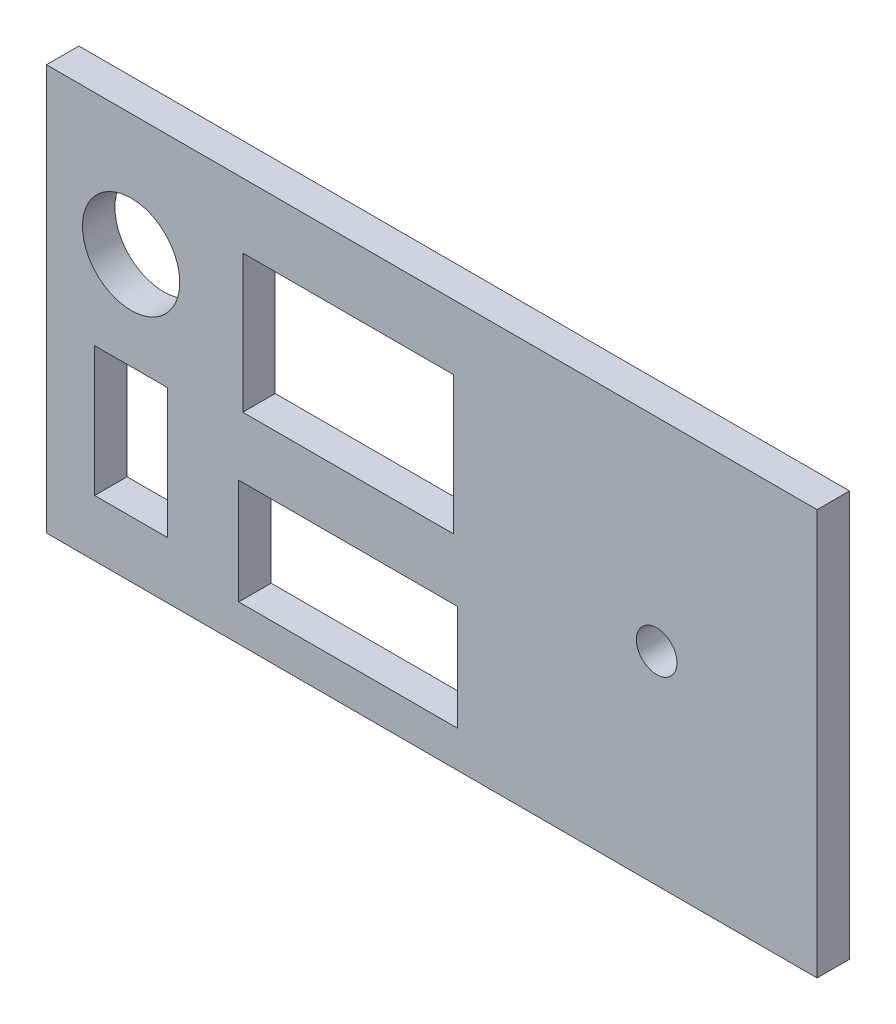
ISO-10303-21;
HEADER;
FILE_DESCRIPTION(('STEP AP214'),'2;1');
FILE_NAME('part.step','',(''),(''),'','','');
FILE_SCHEMA(('AUTOMOTIVE_DESIGN { 1 0 10303 214 1 1 1 1 }'));
ENDSEC;
DATA;
#1=APPLICATION_CONTEXT('core data for automotive mechanical design processes');
#2=APPLICATION_PROTOCOL_DEFINITION('international standard','automotive_design',2000,#1);
#3=PRODUCT_CONTEXT('',#1,'mechanical');
#4=PRODUCT('Part','Part','',(#3));
#5=PRODUCT_RELATED_PRODUCT_CATEGORY('part','',(#4));
#6=PRODUCT_DEFINITION_FORMATION('','',#4);
#7=PRODUCT_DEFINITION_CONTEXT('part definition',#1,'design');
#8=PRODUCT_DEFINITION('design','',#6,#7);
#9=PRODUCT_DEFINITION_SHAPE('','',#8);
#10=(LENGTH_UNIT() NAMED_UNIT(*) SI_UNIT(.MILLI.,.METRE.));
#11=(NAMED_UNIT(*) PLANE_ANGLE_UNIT() SI_UNIT($,.RADIAN.));
#12=(NAMED_UNIT(*) SI_UNIT($,.STERADIAN.) SOLID_ANGLE_UNIT());
#13=UNCERTAINTY_MEASURE_WITH_UNIT(LENGTH_MEASURE(1.E-05),#10,'distance_accuracy_value','');
#14=(GEOMETRIC_REPRESENTATION_CONTEXT(3) GLOBAL_UNCERTAINTY_ASSIGNED_CONTEXT((#13)) GLOBAL_UNIT_ASSIGNED_CONTEXT((#10,
#11,#12)) REPRESENTATION_CONTEXT('',''));
#15=CARTESIAN_POINT('',(0.,0.,0.));
#16=DIRECTION('',(0.,0.,1.));
#17=DIRECTION('',(1.,0.,0.));
#18=AXIS2_PLACEMENT_3D('',#15,#16,#17);
#19=CARTESIAN_POINT('',(0.,0.,4.));
#20=DIRECTION('',(0.,0.,1.));
#21=DIRECTION('',(1.,0.,0.));
#22=AXIS2_PLACEMENT_3D('',#19,#20,#21);
#23=PLANE('',#22);
#24=CARTESIAN_POINT('',(-36.0722,-48.7036,4.));
#25=DIRECTION('',(0.,0.,1.));
#26=DIRECTION('',(-1.,0.,0.));
#27=AXIS2_PLACEMENT_3D('',#24,#25,#26);
#28=ELLIPSE('',#27,2.5,2.5);
#29=CARTESIAN_POINT('',(-38.5722,-48.7036,4.));
#30=VERTEX_POINT('',#29);
#31=EDGE_CURVE('E221',#30,#30,#28,.T.);
#32=ORIENTED_EDGE('',*,*,#31,.F.);
#33=EDGE_LOOP('',(#32));
#34=FACE_BOUND('',#33,.T.);
#35=DIRECTION('',(0.,-1.,0.));
#36=VECTOR('',#35,1.);
#37=CARTESIAN_POINT('',(-111.2985,-23.7036,4.));
#38=LINE('',#37,#36);
#39=CARTESIAN_POINT('',(-111.2985,-23.7036,4.));
#40=VERTEX_POINT('',#39);
#41=CARTESIAN_POINT('',(-111.2985,-73.7036,4.));
#42=VERTEX_POINT('',#41);
#43=EDGE_CURVE('E316',#40,#42,#38,.T.);
#44=ORIENTED_EDGE('',*,*,#43,.T.);
#45=DIRECTION('',(1.,0.,0.));
#46=VECTOR('',#45,1.);
#47=CARTESIAN_POINT('',(-111.2985,-73.7036,4.));
#48=LINE('',#47,#46);
#49=CARTESIAN_POINT('',(-16.2985,-73.7036,4.));
#50=VERTEX_POINT('',#49);
#51=EDGE_CURVE('E320',#42,#50,#48,.T.);
#52=ORIENTED_EDGE('',*,*,#51,.T.);
#53=DIRECTION('',(0.,1.,0.));
#54=VECTOR('',#53,1.);
#55=CARTESIAN_POINT('',(-16.2985,-73.7036,4.));
#56=LINE('',#55,#54);
#57=CARTESIAN_POINT('',(-16.2985,-23.7036,4.));
#58=VERTEX_POINT('',#57);
#59=EDGE_CURVE('E324',#50,#58,#56,.T.);
#60=ORIENTED_EDGE('',*,*,#59,.T.);
#61=DIRECTION('',(-1.,0.,0.));
#62=VECTOR('',#61,1.);
#63=CARTESIAN_POINT('',(-16.2985,-23.7036,4.));
#64=LINE('',#63,#62);
#65=EDGE_CURVE('E327',#58,#40,#64,.T.);
#66=ORIENTED_EDGE('',*,*,#65,.T.);
#67=EDGE_LOOP('',(#44,#52,#60,#66));
#68=FACE_BOUND('',#67,.T.);
#69=DIRECTION('',(1.,0.,0.));
#70=VECTOR('',#69,1.);
#71=CARTESIAN_POINT('',(-87.0985,-48.7036,4.));
#72=LINE('',#71,#70);
#73=CARTESIAN_POINT('',(-87.0985,-48.7036,4.));
#74=VERTEX_POINT('',#73);
#75=CARTESIAN_POINT('',(-61.0985,-48.7036,4.));
#76=VERTEX_POINT('',#75);
#77=EDGE_CURVE('E276',#74,#76,#72,.T.);
#78=ORIENTED_EDGE('',*,*,#77,.F.);
#79=DIRECTION('',(0.,-1.,0.));
#80=VECTOR('',#79,1.);
#81=CARTESIAN_POINT('',(-87.0985,-31.7036,4.));
#82=LINE('',#81,#80);
#83=CARTESIAN_POINT('',(-87.0985,-31.7036,4.));
#84=VERTEX_POINT('',#83);
#85=EDGE_CURVE('E273',#84,#74,#82,.T.);
#86=ORIENTED_EDGE('',*,*,#85,.F.);
#87=DIRECTION('',(-1.,0.,0.));
#88=VECTOR('',#87,1.);
#89=CARTESIAN_POINT('',(-61.0985,-31.7036,4.));
#90=LINE('',#89,#88);
#91=CARTESIAN_POINT('',(-61.0985,-31.7036,4.));
#92=VERTEX_POINT('',#91);
#93=EDGE_CURVE('E284',#92,#84,#90,.T.);
#94=ORIENTED_EDGE('',*,*,#93,.F.);
#95=DIRECTION('',(0.,1.,0.));
#96=VECTOR('',#95,1.);
#97=CARTESIAN_POINT('',(-61.0985,-48.7036,4.));
#98=LINE('',#97,#96);
#99=EDGE_CURVE('E280',#76,#92,#98,.T.);
#100=ORIENTED_EDGE('',*,*,#99,.F.);
#101=EDGE_LOOP('',(#78,#86,#94,#100));
#102=FACE_BOUND('',#101,.T.);
#103=DIRECTION('',(1.,0.,0.));
#104=VECTOR('',#103,1.);
#105=CARTESIAN_POINT('',(-87.5985,-69.2036,4.));
#106=LINE('',#105,#104);
#107=CARTESIAN_POINT('',(-87.5985,-69.2036,4.));
#108=VERTEX_POINT('',#107);
#109=CARTESIAN_POINT('',(-60.5985,-69.2036,4.));
#110=VERTEX_POINT('',#109);
#111=EDGE_CURVE('E233',#108,#110,#106,.T.);
#112=ORIENTED_EDGE('',*,*,#111,.F.);
#113=DIRECTION('',(0.,-1.,0.));
#114=VECTOR('',#113,1.);
#115=CARTESIAN_POINT('',(-87.5985,-56.2036,4.));
#116=LINE('',#115,#114);
#117=CARTESIAN_POINT('',(-87.5985,-56.2036,4.));
#118=VERTEX_POINT('',#117);
#119=EDGE_CURVE('E230',#118,#108,#116,.T.);
#120=ORIENTED_EDGE('',*,*,#119,.F.);
#121=DIRECTION('',(-1.,0.,0.));
#122=VECTOR('',#121,1.);
#123=CARTESIAN_POINT('',(-60.5985,-56.2036,4.));
#124=LINE('',#123,#122);
#125=CARTESIAN_POINT('',(-60.5985,-56.2036,4.));
#126=VERTEX_POINT('',#125);
#127=EDGE_CURVE('E241',#126,#118,#124,.T.);
#128=ORIENTED_EDGE('',*,*,#127,.F.);
#129=DIRECTION('',(0.,1.,0.));
#130=VECTOR('',#129,1.);
#131=CARTESIAN_POINT('',(-60.5985,-69.2036,4.));
#132=LINE('',#131,#130);
#133=EDGE_CURVE('E237',#110,#126,#132,.T.);
#134=ORIENTED_EDGE('',*,*,#133,.F.);
#135=EDGE_LOOP('',(#112,#120,#128,#134));
#136=FACE_BOUND('',#135,.T.);
#137=CARTESIAN_POINT('',(-100.8596,-38.7221,4.));
#138=DIRECTION('',(0.,0.,1.));
#139=DIRECTION('',(-1.,0.,0.));
#140=AXIS2_PLACEMENT_3D('',#137,#138,#139);
#141=ELLIPSE('',#140,6.00000000000001,6.);
#142=CARTESIAN_POINT('',(-106.8596,-38.7221,4.));
#143=VERTEX_POINT('',#142);
#144=EDGE_CURVE('E201',#143,#143,#141,.T.);
#145=ORIENTED_EDGE('',*,*,#144,.F.);
#146=EDGE_LOOP('',(#145));
#147=FACE_BOUND('',#146,.T.);
#148=DIRECTION('',(1.,0.,0.));
#149=VECTOR('',#148,1.);
#150=CARTESIAN_POINT('',(-105.3596,-66.7221,4.));
#151=LINE('',#150,#149);
#152=CARTESIAN_POINT('',(-105.3596,-66.7221,4.));
#153=VERTEX_POINT('',#152);
#154=CARTESIAN_POINT('',(-96.3596,-66.7221,4.));
#155=VERTEX_POINT('',#154);
#156=EDGE_CURVE('E162',#153,#155,#151,.T.);
#157=ORIENTED_EDGE('',*,*,#156,.F.);
#158=DIRECTION('',(0.,-1.,0.));
#159=VECTOR('',#158,1.);
#160=CARTESIAN_POINT('',(-105.3596,-50.7221,4.));
#161=LINE('',#160,#159);
#162=CARTESIAN_POINT('',(-105.3596,-50.7221,4.));
#163=VERTEX_POINT('',#162);
#164=EDGE_CURVE('E153',#163,#153,#161,.T.);
#165=ORIENTED_EDGE('',*,*,#164,.F.);
#166=DIRECTION('',(-1.,0.,0.));
#167=VECTOR('',#166,1.);
#168=CARTESIAN_POINT('',(-96.3596,-50.7221,4.));
#169=LINE('',#168,#167);
#170=CARTESIAN_POINT('',(-96.3596,-50.7221,4.));
#171=VERTEX_POINT('',#170);
#172=EDGE_CURVE('E179',#171,#163,#169,.T.);
#173=ORIENTED_EDGE('',*,*,#172,.F.);
#174=DIRECTION('',(0.,1.,0.));
#175=VECTOR('',#174,1.);
#176=CARTESIAN_POINT('',(-96.3596,-66.7221,4.));
#177=LINE('',#176,#175);
#178=EDGE_CURVE('E175',#155,#171,#177,.T.);
#179=ORIENTED_EDGE('',*,*,#178,.F.);
#180=EDGE_LOOP('',(#157,#165,#173,#179));
#181=FACE_BOUND('',#180,.T.);
#182=ADVANCED_FACE('F39',(#34,#68,#102,#136,#147,#181),#23,.T.);
#183=CARTESIAN_POINT('',(0.,0.,0.));
#184=DIRECTION('',(0.,0.,1.));
#185=DIRECTION('',(1.,0.,0.));
#186=AXIS2_PLACEMENT_3D('',#183,#184,#185);
#187=PLANE('',#186);
#188=CARTESIAN_POINT('',(-100.8596,-38.7221,0.));
#189=DIRECTION('',(0.,0.,1.));
#190=DIRECTION('',(-1.,0.,0.));
#191=AXIS2_PLACEMENT_3D('',#188,#189,#190);
#192=ELLIPSE('',#191,6.00000000000001,6.);
#193=CARTESIAN_POINT('',(-106.8596,-38.7221,0.));
#194=VERTEX_POINT('',#193);
#195=EDGE_CURVE('E171',#194,#194,#192,.T.);
#196=ORIENTED_EDGE('',*,*,#195,.T.);
#197=EDGE_LOOP('',(#196));
#198=FACE_BOUND('',#197,.T.);
#199=CARTESIAN_POINT('',(-36.0722,-48.7036,0.));
#200=DIRECTION('',(0.,0.,1.));
#201=DIRECTION('',(-1.,0.,0.));
#202=AXIS2_PLACEMENT_3D('',#199,#200,#201);
#203=ELLIPSE('',#202,2.5,2.5);
#204=CARTESIAN_POINT('',(-38.5722,-48.7036,0.));
#205=VERTEX_POINT('',#204);
#206=EDGE_CURVE('E206',#205,#205,#203,.T.);
#207=ORIENTED_EDGE('',*,*,#206,.T.);
#208=EDGE_LOOP('',(#207));
#209=FACE_BOUND('',#208,.T.);
#210=DIRECTION('',(0.,-1.,0.));
#211=VECTOR('',#210,1.);
#212=CARTESIAN_POINT('',(-87.5985,-56.2036,0.));
#213=LINE('',#212,#211);
#214=CARTESIAN_POINT('',(-87.5985,-56.2036,0.));
#215=VERTEX_POINT('',#214);
#216=CARTESIAN_POINT('',(-87.5985,-69.2036,0.));
#217=VERTEX_POINT('',#216);
#218=EDGE_CURVE('E226',#215,#217,#213,.T.);
#219=ORIENTED_EDGE('',*,*,#218,.T.);
#220=DIRECTION('',(1.,0.,0.));
#221=VECTOR('',#220,1.);
#222=CARTESIAN_POINT('',(-87.5985,-69.2036,0.));
#223=LINE('',#222,#221);
#224=CARTESIAN_POINT('',(-60.5985,-69.2036,0.));
#225=VERTEX_POINT('',#224);
#226=EDGE_CURVE('E248',#217,#225,#223,.T.);
#227=ORIENTED_EDGE('',*,*,#226,.T.);
#228=DIRECTION('',(0.,1.,0.));
#229=VECTOR('',#228,1.);
#230=CARTESIAN_POINT('',(-60.5985,-69.2036,0.));
#231=LINE('',#230,#229);
#232=CARTESIAN_POINT('',(-60.5985,-56.2036,0.));
#233=VERTEX_POINT('',#232);
#234=EDGE_CURVE('E252',#225,#233,#231,.T.);
#235=ORIENTED_EDGE('',*,*,#234,.T.);
#236=DIRECTION('',(-1.,0.,0.));
#237=VECTOR('',#236,1.);
#238=CARTESIAN_POINT('',(-60.5985,-56.2036,0.));
#239=LINE('',#238,#237);
#240=EDGE_CURVE('E234',#233,#215,#239,.T.);
#241=ORIENTED_EDGE('',*,*,#240,.T.);
#242=EDGE_LOOP('',(#219,#227,#235,#241));
#243=FACE_BOUND('',#242,.T.);
#244=DIRECTION('',(0.,-1.,0.));
#245=VECTOR('',#244,1.);
#246=CARTESIAN_POINT('',(-111.2985,-23.7036,0.));
#247=LINE('',#246,#245);
#248=CARTESIAN_POINT('',(-111.2985,-23.7036,0.));
#249=VERTEX_POINT('',#248);
#250=CARTESIAN_POINT('',(-111.2985,-73.7036,0.));
#251=VERTEX_POINT('',#250);
#252=EDGE_CURVE('E315',#249,#251,#247,.T.);
#253=ORIENTED_EDGE('',*,*,#252,.F.);
#254=DIRECTION('',(-1.,0.,0.));
#255=VECTOR('',#254,1.);
#256=CARTESIAN_POINT('',(-16.2985,-23.7036,0.));
#257=LINE('',#256,#255);
#258=CARTESIAN_POINT('',(-16.2985,-23.7036,0.));
#259=VERTEX_POINT('',#258);
#260=EDGE_CURVE('E321',#259,#249,#257,.T.);
#261=ORIENTED_EDGE('',*,*,#260,.F.);
#262=DIRECTION('',(0.,1.,0.));
#263=VECTOR('',#262,1.);
#264=CARTESIAN_POINT('',(-16.2985,-73.7036,0.));
#265=LINE('',#264,#263);
#266=CARTESIAN_POINT('',(-16.2985,-73.7036,0.));
#267=VERTEX_POINT('',#266);
#268=EDGE_CURVE('E337',#267,#259,#265,.T.);
#269=ORIENTED_EDGE('',*,*,#268,.F.);
#270=DIRECTION('',(1.,0.,0.));
#271=VECTOR('',#270,1.);
#272=CARTESIAN_POINT('',(-111.2985,-73.7036,0.));
#273=LINE('',#272,#271);
#274=EDGE_CURVE('E334',#251,#267,#273,.T.);
#275=ORIENTED_EDGE('',*,*,#274,.F.);
#276=EDGE_LOOP('',(#253,#261,#269,#275));
#277=FACE_BOUND('',#276,.T.);
#278=DIRECTION('',(0.,-1.,0.));
#279=VECTOR('',#278,1.);
#280=CARTESIAN_POINT('',(-87.0985,-31.7036,0.));
#281=LINE('',#280,#279);
#282=CARTESIAN_POINT('',(-87.0985,-31.7036,0.));
#283=VERTEX_POINT('',#282);
#284=CARTESIAN_POINT('',(-87.0985,-48.7036,0.));
#285=VERTEX_POINT('',#284);
#286=EDGE_CURVE('E272',#283,#285,#281,.T.);
#287=ORIENTED_EDGE('',*,*,#286,.T.);
#288=DIRECTION('',(1.,0.,0.));
#289=VECTOR('',#288,1.);
#290=CARTESIAN_POINT('',(-87.0985,-48.7036,0.));
#291=LINE('',#290,#289);
#292=CARTESIAN_POINT('',(-61.0985,-48.7036,0.));
#293=VERTEX_POINT('',#292);
#294=EDGE_CURVE('E291',#285,#293,#291,.T.);
#295=ORIENTED_EDGE('',*,*,#294,.T.);
#296=DIRECTION('',(0.,1.,0.));
#297=VECTOR('',#296,1.);
#298=CARTESIAN_POINT('',(-61.0985,-48.7036,0.));
#299=LINE('',#298,#297);
#300=CARTESIAN_POINT('',(-61.0985,-31.7036,0.));
#301=VERTEX_POINT('',#300);
#302=EDGE_CURVE('E295',#293,#301,#299,.T.);
#303=ORIENTED_EDGE('',*,*,#302,.T.);
#304=DIRECTION('',(-1.,0.,0.));
#305=VECTOR('',#304,1.);
#306=CARTESIAN_POINT('',(-61.0985,-31.7036,0.));
#307=LINE('',#306,#305);
#308=EDGE_CURVE('E277',#301,#283,#307,.T.);
#309=ORIENTED_EDGE('',*,*,#308,.T.);
#310=EDGE_LOOP('',(#287,#295,#303,#309));
#311=FACE_BOUND('',#310,.T.);
#312=DIRECTION('',(0.,-1.,0.));
#313=VECTOR('',#312,1.);
#314=CARTESIAN_POINT('',(-105.3596,-50.7221,0.));
#315=LINE('',#314,#313);
#316=CARTESIAN_POINT('',(-105.3596,-50.7221,0.));
#317=VERTEX_POINT('',#316);
#318=CARTESIAN_POINT('',(-105.3596,-66.7221,0.));
#319=VERTEX_POINT('',#318);
#320=EDGE_CURVE('E63',#317,#319,#315,.T.);
#321=ORIENTED_EDGE('',*,*,#320,.T.);
#322=DIRECTION('',(1.,0.,0.));
#323=VECTOR('',#322,1.);
#324=CARTESIAN_POINT('',(-105.3596,-66.7221,0.));
#325=LINE('',#324,#323);
#326=CARTESIAN_POINT('',(-96.3596,-66.7221,0.));
#327=VERTEX_POINT('',#326);
#328=EDGE_CURVE('E169',#319,#327,#325,.T.);
#329=ORIENTED_EDGE('',*,*,#328,.T.);
#330=DIRECTION('',(0.,1.,0.));
#331=VECTOR('',#330,1.);
#332=CARTESIAN_POINT('',(-96.3596,-66.7221,0.));
#333=LINE('',#332,#331);
#334=CARTESIAN_POINT('',(-96.3596,-50.7221,0.));
#335=VERTEX_POINT('',#334);
#336=EDGE_CURVE('E188',#327,#335,#333,.T.);
#337=ORIENTED_EDGE('',*,*,#336,.T.);
#338=DIRECTION('',(-1.,0.,0.));
#339=VECTOR('',#338,1.);
#340=CARTESIAN_POINT('',(-96.3596,-50.7221,0.));
#341=LINE('',#340,#339);
#342=EDGE_CURVE('E163',#335,#317,#341,.T.);
#343=ORIENTED_EDGE('',*,*,#342,.T.);
#344=EDGE_LOOP('',(#321,#329,#337,#343));
#345=FACE_BOUND('',#344,.T.);
#346=ADVANCED_FACE('F360',(#198,#209,#243,#277,#311,#345),#187,.F.);
#347=CARTESIAN_POINT('',(-111.2985,-23.7036,4.));
#348=DIRECTION('',(1.,0.,0.));
#349=DIRECTION('',(0.,0.,-1.));
#350=AXIS2_PLACEMENT_3D('',#347,#348,#349);
#351=PLANE('',#350);
#352=ORIENTED_EDGE('',*,*,#252,.T.);
#353=DIRECTION('',(0.,0.,-1.));
#354=VECTOR('',#353,1.);
#355=CARTESIAN_POINT('',(-111.2985,-73.7036,4.));
#356=LINE('',#355,#354);
#357=EDGE_CURVE('E11',#42,#251,#356,.T.);
#358=ORIENTED_EDGE('',*,*,#357,.F.);
#359=ORIENTED_EDGE('',*,*,#43,.F.);
#360=DIRECTION('',(0.,0.,-1.));
#361=VECTOR('',#360,1.);
#362=CARTESIAN_POINT('',(-111.2985,-23.7036,4.));
#363=LINE('',#362,#361);
#364=EDGE_CURVE('E330',#40,#249,#363,.T.);
#365=ORIENTED_EDGE('',*,*,#364,.T.);
#366=EDGE_LOOP('',(#352,#358,#359,#365));
#367=FACE_BOUND('',#366,.T.);
#368=ADVANCED_FACE('F41',(#367),#351,.F.);
#369=CARTESIAN_POINT('',(-111.2985,-73.7036,4.));
#370=DIRECTION('',(0.,1.,0.));
#371=DIRECTION('',(0.,0.,1.));
#372=AXIS2_PLACEMENT_3D('',#369,#370,#371);
#373=PLANE('',#372);
#374=ORIENTED_EDGE('',*,*,#274,.T.);
#375=DIRECTION('',(0.,0.,-1.));
#376=VECTOR('',#375,1.);
#377=CARTESIAN_POINT('',(-16.2985,-73.7036,4.));
#378=LINE('',#377,#376);
#379=EDGE_CURVE('E48',#50,#267,#378,.T.);
#380=ORIENTED_EDGE('',*,*,#379,.F.);
#381=ORIENTED_EDGE('',*,*,#51,.F.);
#382=ORIENTED_EDGE('',*,*,#357,.T.);
#383=EDGE_LOOP('',(#374,#380,#381,#382));
#384=FACE_BOUND('',#383,.T.);
#385=ADVANCED_FACE('F371',(#384),#373,.F.);
#386=CARTESIAN_POINT('',(-16.2985,-73.7036,4.));
#387=DIRECTION('',(-1.,0.,0.));
#388=DIRECTION('',(0.,0.,1.));
#389=AXIS2_PLACEMENT_3D('',#386,#387,#388);
#390=PLANE('',#389);
#391=ORIENTED_EDGE('',*,*,#268,.T.);
#392=DIRECTION('',(0.,0.,-1.));
#393=VECTOR('',#392,1.);
#394=CARTESIAN_POINT('',(-16.2985,-23.7036,4.));
#395=LINE('',#394,#393);
#396=EDGE_CURVE('E345',#58,#259,#395,.T.);
#397=ORIENTED_EDGE('',*,*,#396,.F.);
#398=ORIENTED_EDGE('',*,*,#59,.F.);
#399=ORIENTED_EDGE('',*,*,#379,.T.);
#400=EDGE_LOOP('',(#391,#397,#398,#399));
#401=FACE_BOUND('',#400,.T.);
#402=ADVANCED_FACE('F354',(#401),#390,.F.);
#403=CARTESIAN_POINT('',(-16.2985,-23.7036,4.));
#404=DIRECTION('',(0.,-1.,0.));
#405=DIRECTION('',(0.,0.,-1.));
#406=AXIS2_PLACEMENT_3D('',#403,#404,#405);
#407=PLANE('',#406);
#408=ORIENTED_EDGE('',*,*,#260,.T.);
#409=ORIENTED_EDGE('',*,*,#364,.F.);
#410=ORIENTED_EDGE('',*,*,#65,.F.);
#411=ORIENTED_EDGE('',*,*,#396,.T.);
#412=EDGE_LOOP('',(#408,#409,#410,#411));
#413=FACE_BOUND('',#412,.T.);
#414=ADVANCED_FACE('F364',(#413),#407,.F.);
#415=CARTESIAN_POINT('',(-87.0985,-31.7036,4.));
#416=DIRECTION('',(1.,0.,0.));
#417=DIRECTION('',(0.,0.,-1.));
#418=AXIS2_PLACEMENT_3D('',#415,#416,#417);
#419=PLANE('',#418);
#420=ORIENTED_EDGE('',*,*,#286,.F.);
#421=DIRECTION('',(0.,0.,-1.));
#422=VECTOR('',#421,1.);
#423=CARTESIAN_POINT('',(-87.0985,-31.7036,4.));
#424=LINE('',#423,#422);
#425=EDGE_CURVE('E287',#84,#283,#424,.T.);
#426=ORIENTED_EDGE('',*,*,#425,.F.);
#427=ORIENTED_EDGE('',*,*,#85,.T.);
#428=DIRECTION('',(0.,0.,-1.));
#429=VECTOR('',#428,1.);
#430=CARTESIAN_POINT('',(-87.0985,-48.7036,4.));
#431=LINE('',#430,#429);
#432=EDGE_CURVE('E311',#74,#285,#431,.T.);
#433=ORIENTED_EDGE('',*,*,#432,.T.);
#434=EDGE_LOOP('',(#420,#426,#427,#433));
#435=FACE_BOUND('',#434,.T.);
#436=ADVANCED_FACE('F388',(#435),#419,.T.);
#437=CARTESIAN_POINT('',(-87.0985,-48.7036,4.));
#438=DIRECTION('',(0.,1.,0.));
#439=DIRECTION('',(0.,0.,1.));
#440=AXIS2_PLACEMENT_3D('',#437,#438,#439);
#441=PLANE('',#440);
#442=ORIENTED_EDGE('',*,*,#294,.F.);
#443=ORIENTED_EDGE('',*,*,#432,.F.);
#444=ORIENTED_EDGE('',*,*,#77,.T.);
#445=DIRECTION('',(0.,0.,-1.));
#446=VECTOR('',#445,1.);
#447=CARTESIAN_POINT('',(-61.0985,-48.7036,4.));
#448=LINE('',#447,#446);
#449=EDGE_CURVE('E308',#76,#293,#448,.T.);
#450=ORIENTED_EDGE('',*,*,#449,.T.);
#451=EDGE_LOOP('',(#442,#443,#444,#450));
#452=FACE_BOUND('',#451,.T.);
#453=ADVANCED_FACE('F395',(#452),#441,.T.);
#454=CARTESIAN_POINT('',(-61.0985,-48.7036,4.));
#455=DIRECTION('',(-1.,0.,0.));
#456=DIRECTION('',(0.,0.,1.));
#457=AXIS2_PLACEMENT_3D('',#454,#455,#456);
#458=PLANE('',#457);
#459=ORIENTED_EDGE('',*,*,#302,.F.);
#460=ORIENTED_EDGE('',*,*,#449,.F.);
#461=ORIENTED_EDGE('',*,*,#99,.T.);
#462=DIRECTION('',(0.,0.,-1.));
#463=VECTOR('',#462,1.);
#464=CARTESIAN_POINT('',(-61.0985,-31.7036,4.));
#465=LINE('',#464,#463);
#466=EDGE_CURVE('E305',#92,#301,#465,.T.);
#467=ORIENTED_EDGE('',*,*,#466,.T.);
#468=EDGE_LOOP('',(#459,#460,#461,#467));
#469=FACE_BOUND('',#468,.T.);
#470=ADVANCED_FACE('F400',(#469),#458,.T.);
#471=CARTESIAN_POINT('',(-61.0985,-31.7036,4.));
#472=DIRECTION('',(0.,-1.,0.));
#473=DIRECTION('',(0.,0.,-1.));
#474=AXIS2_PLACEMENT_3D('',#471,#472,#473);
#475=PLANE('',#474);
#476=ORIENTED_EDGE('',*,*,#308,.F.);
#477=ORIENTED_EDGE('',*,*,#466,.F.);
#478=ORIENTED_EDGE('',*,*,#93,.T.);
#479=ORIENTED_EDGE('',*,*,#425,.T.);
#480=EDGE_LOOP('',(#476,#477,#478,#479));
#481=FACE_BOUND('',#480,.T.);
#482=ADVANCED_FACE('F407',(#481),#475,.T.);
#483=CARTESIAN_POINT('',(-87.5985,-56.2036,4.));
#484=DIRECTION('',(1.,0.,0.));
#485=DIRECTION('',(0.,0.,-1.));
#486=AXIS2_PLACEMENT_3D('',#483,#484,#485);
#487=PLANE('',#486);
#488=ORIENTED_EDGE('',*,*,#218,.F.);
#489=DIRECTION('',(0.,0.,-1.));
#490=VECTOR('',#489,1.);
#491=CARTESIAN_POINT('',(-87.5985,-56.2036,4.));
#492=LINE('',#491,#490);
#493=EDGE_CURVE('E244',#118,#215,#492,.T.);
#494=ORIENTED_EDGE('',*,*,#493,.F.);
#495=ORIENTED_EDGE('',*,*,#119,.T.);
#496=DIRECTION('',(0.,0.,-1.));
#497=VECTOR('',#496,1.);
#498=CARTESIAN_POINT('',(-87.5985,-69.2036,4.));
#499=LINE('',#498,#497);
#500=EDGE_CURVE('E268',#108,#217,#499,.T.);
#501=ORIENTED_EDGE('',*,*,#500,.T.);
#502=EDGE_LOOP('',(#488,#494,#495,#501));
#503=FACE_BOUND('',#502,.T.);
#504=ADVANCED_FACE('F431',(#503),#487,.T.);
#505=CARTESIAN_POINT('',(-87.5985,-69.2036,4.));
#506=DIRECTION('',(0.,1.,0.));
#507=DIRECTION('',(0.,0.,1.));
#508=AXIS2_PLACEMENT_3D('',#505,#506,#507);
#509=PLANE('',#508);
#510=ORIENTED_EDGE('',*,*,#226,.F.);
#511=ORIENTED_EDGE('',*,*,#500,.F.);
#512=ORIENTED_EDGE('',*,*,#111,.T.);
#513=DIRECTION('',(0.,0.,-1.));
#514=VECTOR('',#513,1.);
#515=CARTESIAN_POINT('',(-60.5985,-69.2036,4.));
#516=LINE('',#515,#514);
#517=EDGE_CURVE('E265',#110,#225,#516,.T.);
#518=ORIENTED_EDGE('',*,*,#517,.T.);
#519=EDGE_LOOP('',(#510,#511,#512,#518));
#520=FACE_BOUND('',#519,.T.);
#521=ADVANCED_FACE('F436',(#520),#509,.T.);
#522=CARTESIAN_POINT('',(-60.5985,-69.2036,4.));
#523=DIRECTION('',(-1.,0.,0.));
#524=DIRECTION('',(0.,0.,1.));
#525=AXIS2_PLACEMENT_3D('',#522,#523,#524);
#526=PLANE('',#525);
#527=ORIENTED_EDGE('',*,*,#234,.F.);
#528=ORIENTED_EDGE('',*,*,#517,.F.);
#529=ORIENTED_EDGE('',*,*,#133,.T.);
#530=DIRECTION('',(0.,0.,-1.));
#531=VECTOR('',#530,1.);
#532=CARTESIAN_POINT('',(-60.5985,-56.2036,4.));
#533=LINE('',#532,#531);
#534=EDGE_CURVE('E262',#126,#233,#533,.T.);
#535=ORIENTED_EDGE('',*,*,#534,.T.);
#536=EDGE_LOOP('',(#527,#528,#529,#535));
#537=FACE_BOUND('',#536,.T.);
#538=ADVANCED_FACE('F440',(#537),#526,.T.);
#539=CARTESIAN_POINT('',(-60.5985,-56.2036,4.));
#540=DIRECTION('',(0.,-1.,0.));
#541=DIRECTION('',(0.,0.,-1.));
#542=AXIS2_PLACEMENT_3D('',#539,#540,#541);
#543=PLANE('',#542);
#544=ORIENTED_EDGE('',*,*,#240,.F.);
#545=ORIENTED_EDGE('',*,*,#534,.F.);
#546=ORIENTED_EDGE('',*,*,#127,.T.);
#547=ORIENTED_EDGE('',*,*,#493,.T.);
#548=EDGE_LOOP('',(#544,#545,#546,#547));
#549=FACE_BOUND('',#548,.T.);
#550=ADVANCED_FACE('F218',(#549),#543,.T.);
#551=DIRECTION('',(0.,0.,-1.));
#552=VECTOR('',#551,1.);
#553=SURFACE_OF_LINEAR_EXTRUSION('',#28,#552);
#554=ORIENTED_EDGE('',*,*,#31,.T.);
#555=EDGE_LOOP('',(#554));
#556=FACE_BOUND('',#555,.T.);
#557=ORIENTED_EDGE('',*,*,#206,.F.);
#558=EDGE_LOOP('',(#557));
#559=FACE_BOUND('',#558,.T.);
#560=ADVANCED_FACE('F213',(#556,#559),#553,.T.);
#561=DIRECTION('',(0.,0.,-1.));
#562=VECTOR('',#561,1.);
#563=SURFACE_OF_LINEAR_EXTRUSION('',#141,#562);
#564=ORIENTED_EDGE('',*,*,#144,.T.);
#565=EDGE_LOOP('',(#564));
#566=FACE_BOUND('',#565,.T.);
#567=ORIENTED_EDGE('',*,*,#195,.F.);
#568=EDGE_LOOP('',(#567));
#569=FACE_BOUND('',#568,.T.);
#570=ADVANCED_FACE('F209',(#566,#569),#563,.T.);
#571=CARTESIAN_POINT('',(-105.3596,-50.7221,4.));
#572=DIRECTION('',(1.,0.,0.));
#573=DIRECTION('',(0.,0.,-1.));
#574=AXIS2_PLACEMENT_3D('',#571,#572,#573);
#575=PLANE('',#574);
#576=ORIENTED_EDGE('',*,*,#320,.F.);
#577=DIRECTION('',(0.,0.,-1.));
#578=VECTOR('',#577,1.);
#579=CARTESIAN_POINT('',(-105.3596,-50.7221,4.));
#580=LINE('',#579,#578);
#581=EDGE_CURVE('E157',#163,#317,#580,.T.);
#582=ORIENTED_EDGE('',*,*,#581,.F.);
#583=ORIENTED_EDGE('',*,*,#164,.T.);
#584=DIRECTION('',(0.,0.,-1.));
#585=VECTOR('',#584,1.);
#586=CARTESIAN_POINT('',(-105.3596,-66.7221,4.));
#587=LINE('',#586,#585);
#588=EDGE_CURVE('E156',#153,#319,#587,.T.);
#589=ORIENTED_EDGE('',*,*,#588,.T.);
#590=EDGE_LOOP('',(#576,#582,#583,#589));
#591=FACE_BOUND('',#590,.T.);
#592=ADVANCED_FACE('F155',(#591),#575,.T.);
#593=CARTESIAN_POINT('',(-105.3596,-66.7221,4.));
#594=DIRECTION('',(0.,1.,0.));
#595=DIRECTION('',(0.,0.,1.));
#596=AXIS2_PLACEMENT_3D('',#593,#594,#595);
#597=PLANE('',#596);
#598=ORIENTED_EDGE('',*,*,#328,.F.);
#599=ORIENTED_EDGE('',*,*,#588,.F.);
#600=ORIENTED_EDGE('',*,*,#156,.T.);
#601=DIRECTION('',(0.,0.,-1.));
#602=VECTOR('',#601,1.);
#603=CARTESIAN_POINT('',(-96.3596,-66.7221,4.));
#604=LINE('',#603,#602);
#605=EDGE_CURVE('E172',#155,#327,#604,.T.);
#606=ORIENTED_EDGE('',*,*,#605,.T.);
#607=EDGE_LOOP('',(#598,#599,#600,#606));
#608=FACE_BOUND('',#607,.T.);
#609=ADVANCED_FACE('F166',(#608),#597,.T.);
#610=CARTESIAN_POINT('',(-96.3596,-66.7221,4.));
#611=DIRECTION('',(-1.,0.,0.));
#612=DIRECTION('',(0.,0.,1.));
#613=AXIS2_PLACEMENT_3D('',#610,#611,#612);
#614=PLANE('',#613);
#615=ORIENTED_EDGE('',*,*,#336,.F.);
#616=ORIENTED_EDGE('',*,*,#605,.F.);
#617=ORIENTED_EDGE('',*,*,#178,.T.);
#618=DIRECTION('',(0.,0.,-1.));
#619=VECTOR('',#618,1.);
#620=CARTESIAN_POINT('',(-96.3596,-50.7221,4.));
#621=LINE('',#620,#619);
#622=EDGE_CURVE('E55',#171,#335,#621,.T.);
#623=ORIENTED_EDGE('',*,*,#622,.T.);
#624=EDGE_LOOP('',(#615,#616,#617,#623));
#625=FACE_BOUND('',#624,.T.);
#626=ADVANCED_FACE('F507',(#625),#614,.T.);
#627=CARTESIAN_POINT('',(-96.3596,-50.7221,4.));
#628=DIRECTION('',(0.,-1.,0.));
#629=DIRECTION('',(0.,0.,-1.));
#630=AXIS2_PLACEMENT_3D('',#627,#628,#629);
#631=PLANE('',#630);
#632=ORIENTED_EDGE('',*,*,#342,.F.);
#633=ORIENTED_EDGE('',*,*,#622,.F.);
#634=ORIENTED_EDGE('',*,*,#172,.T.);
#635=ORIENTED_EDGE('',*,*,#581,.T.);
#636=EDGE_LOOP('',(#632,#633,#634,#635));
#637=FACE_BOUND('',#636,.T.);
#638=ADVANCED_FACE('F515',(#637),#631,.T.);
#639=CLOSED_SHELL('',(#182,#346,#368,#385,#402,#414,#436,#453,#470,#482,#504,#521,#538,#550,
#560,#570,#592,#609,#626,#638));
#640=MANIFOLD_SOLID_BREP('B2',#639);
#641=ADVANCED_BREP_SHAPE_REPRESENTATION('',(#18,#640),#14);
#642=SHAPE_DEFINITION_REPRESENTATION(#9,#641);
ENDSEC;
END-ISO-10303-21;
